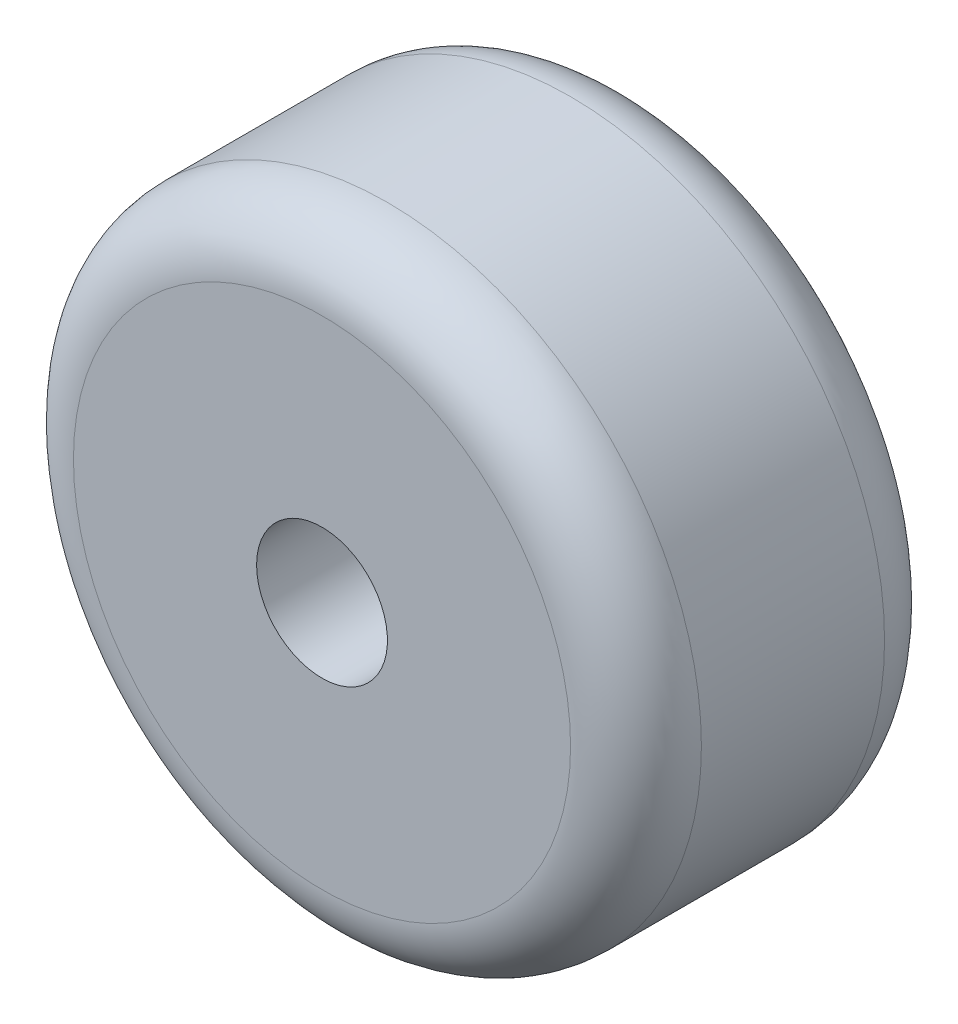
ISO-10303-21;
HEADER;
FILE_DESCRIPTION(('STEP AP214'),'2;1');
FILE_NAME('part.step','',(''),(''),'','','');
FILE_SCHEMA(('AUTOMOTIVE_DESIGN { 1 0 10303 214 1 1 1 1 }'));
ENDSEC;
DATA;
#1=APPLICATION_CONTEXT('core data for automotive mechanical design processes');
#2=APPLICATION_PROTOCOL_DEFINITION('international standard','automotive_design',2000,#1);
#3=PRODUCT_CONTEXT('',#1,'mechanical');
#4=PRODUCT('Part','Part','',(#3));
#5=PRODUCT_RELATED_PRODUCT_CATEGORY('part','',(#4));
#6=PRODUCT_DEFINITION_FORMATION('','',#4);
#7=PRODUCT_DEFINITION_CONTEXT('part definition',#1,'design');
#8=PRODUCT_DEFINITION('design','',#6,#7);
#9=PRODUCT_DEFINITION_SHAPE('','',#8);
#10=(LENGTH_UNIT() NAMED_UNIT(*) SI_UNIT(.MILLI.,.METRE.));
#11=(NAMED_UNIT(*) PLANE_ANGLE_UNIT() SI_UNIT($,.RADIAN.));
#12=(NAMED_UNIT(*) SI_UNIT($,.STERADIAN.) SOLID_ANGLE_UNIT());
#13=UNCERTAINTY_MEASURE_WITH_UNIT(LENGTH_MEASURE(1.E-05),#10,'distance_accuracy_value','');
#14=(GEOMETRIC_REPRESENTATION_CONTEXT(3) GLOBAL_UNCERTAINTY_ASSIGNED_CONTEXT((#13)) GLOBAL_UNIT_ASSIGNED_CONTEXT((#10,
#11,#12)) REPRESENTATION_CONTEXT('',''));
#15=CARTESIAN_POINT('',(0.,0.,0.));
#16=DIRECTION('',(0.,0.,1.));
#17=DIRECTION('',(1.,0.,0.));
#18=AXIS2_PLACEMENT_3D('',#15,#16,#17);
#19=CARTESIAN_POINT('',(0.,0.,24.));
#20=DIRECTION('',(0.,0.,-1.));
#21=DIRECTION('',(-1.,0.,0.));
#22=AXIS2_PLACEMENT_3D('',#19,#20,#21);
#23=CYLINDRICAL_SURFACE('',#22,24.);
#24=CARTESIAN_POINT('',(0.,0.,5.));
#25=DIRECTION('',(0.,0.,1.));
#26=DIRECTION('',(1.,0.,0.));
#27=AXIS2_PLACEMENT_3D('',#24,#25,#26);
#28=CIRCLE('',#27,24.);
#29=CARTESIAN_POINT('',(24.,0.,5.));
#30=VERTEX_POINT('',#29);
#31=EDGE_CURVE('E42',#30,#30,#28,.T.);
#32=ORIENTED_EDGE('',*,*,#31,.T.);
#33=EDGE_LOOP('',(#32));
#34=FACE_BOUND('',#33,.T.);
#35=CARTESIAN_POINT('',(0.,0.,19.));
#36=DIRECTION('',(0.,0.,1.));
#37=DIRECTION('',(1.,0.,0.));
#38=AXIS2_PLACEMENT_3D('',#35,#36,#37);
#39=CIRCLE('',#38,24.);
#40=CARTESIAN_POINT('',(24.,0.,19.));
#41=VERTEX_POINT('',#40);
#42=EDGE_CURVE('E46',#41,#41,#39,.F.);
#43=ORIENTED_EDGE('',*,*,#42,.T.);
#44=EDGE_LOOP('',(#43));
#45=FACE_BOUND('',#44,.T.);
#46=ADVANCED_FACE('F31',(#34,#45),#23,.T.);
#47=CARTESIAN_POINT('',(0.,0.,24.));
#48=DIRECTION('',(0.,0.,1.));
#49=DIRECTION('',(1.,0.,0.));
#50=AXIS2_PLACEMENT_3D('',#47,#48,#49);
#51=PLANE('',#50);
#52=CARTESIAN_POINT('',(0.,0.,24.));
#53=DIRECTION('',(0.,0.,-1.));
#54=DIRECTION('',(-1.,0.,0.));
#55=AXIS2_PLACEMENT_3D('',#52,#53,#54);
#56=CIRCLE('',#55,5.);
#57=CARTESIAN_POINT('',(-5.,0.,24.));
#58=VERTEX_POINT('',#57);
#59=EDGE_CURVE('E51',#58,#58,#56,.T.);
#60=ORIENTED_EDGE('',*,*,#59,.T.);
#61=EDGE_LOOP('',(#60));
#62=FACE_BOUND('',#61,.T.);
#63=CARTESIAN_POINT('',(0.,0.,24.));
#64=DIRECTION('',(0.,0.,1.));
#65=DIRECTION('',(1.,0.,0.));
#66=AXIS2_PLACEMENT_3D('',#63,#64,#65);
#67=CIRCLE('',#66,19.);
#68=CARTESIAN_POINT('',(19.,0.,24.));
#69=VERTEX_POINT('',#68);
#70=EDGE_CURVE('E10',#69,#69,#67,.T.);
#71=ORIENTED_EDGE('',*,*,#70,.T.);
#72=EDGE_LOOP('',(#71));
#73=FACE_BOUND('',#72,.T.);
#74=ADVANCED_FACE('F58',(#62,#73),#51,.T.);
#75=CARTESIAN_POINT('',(0.,0.,0.));
#76=DIRECTION('',(0.,0.,1.));
#77=DIRECTION('',(1.,0.,0.));
#78=AXIS2_PLACEMENT_3D('',#75,#76,#77);
#79=PLANE('',#78);
#80=CARTESIAN_POINT('',(0.,0.,0.));
#81=DIRECTION('',(0.,0.,-1.));
#82=DIRECTION('',(-1.,0.,0.));
#83=AXIS2_PLACEMENT_3D('',#80,#81,#82);
#84=CIRCLE('',#83,5.);
#85=CARTESIAN_POINT('',(-5.,0.,0.));
#86=VERTEX_POINT('',#85);
#87=EDGE_CURVE('E52',#86,#86,#84,.T.);
#88=ORIENTED_EDGE('',*,*,#87,.F.);
#89=EDGE_LOOP('',(#88));
#90=FACE_BOUND('',#89,.T.);
#91=CARTESIAN_POINT('',(0.,0.,0.));
#92=DIRECTION('',(0.,0.,1.));
#93=DIRECTION('',(1.,0.,0.));
#94=AXIS2_PLACEMENT_3D('',#91,#92,#93);
#95=CIRCLE('',#94,19.);
#96=CARTESIAN_POINT('',(19.,0.,0.));
#97=VERTEX_POINT('',#96);
#98=EDGE_CURVE('E38',#97,#97,#95,.F.);
#99=ORIENTED_EDGE('',*,*,#98,.T.);
#100=EDGE_LOOP('',(#99));
#101=FACE_BOUND('',#100,.T.);
#102=ADVANCED_FACE('F66',(#90,#101),#79,.F.);
#103=CARTESIAN_POINT('',(0.,0.,5.));
#104=DIRECTION('',(0.,0.,1.));
#105=DIRECTION('',(1.,0.,0.));
#106=AXIS2_PLACEMENT_3D('',#103,#104,#105);
#107=TOROIDAL_SURFACE('',#106,19.,5.);
#108=ORIENTED_EDGE('',*,*,#98,.F.);
#109=EDGE_LOOP('',(#108));
#110=FACE_BOUND('',#109,.T.);
#111=ORIENTED_EDGE('',*,*,#31,.F.);
#112=EDGE_LOOP('',(#111));
#113=FACE_BOUND('',#112,.T.);
#114=ADVANCED_FACE('F68',(#110,#113),#107,.T.);
#115=CARTESIAN_POINT('',(0.,0.,19.));
#116=DIRECTION('',(0.,0.,1.));
#117=DIRECTION('',(1.,0.,0.));
#118=AXIS2_PLACEMENT_3D('',#115,#116,#117);
#119=TOROIDAL_SURFACE('',#118,19.,5.);
#120=ORIENTED_EDGE('',*,*,#42,.F.);
#121=EDGE_LOOP('',(#120));
#122=FACE_BOUND('',#121,.T.);
#123=ORIENTED_EDGE('',*,*,#70,.F.);
#124=EDGE_LOOP('',(#123));
#125=FACE_BOUND('',#124,.T.);
#126=ADVANCED_FACE('F33',(#122,#125),#119,.T.);
#127=CARTESIAN_POINT('',(0.,0.,24.));
#128=DIRECTION('',(0.,0.,-1.));
#129=DIRECTION('',(-1.,0.,0.));
#130=AXIS2_PLACEMENT_3D('',#127,#128,#129);
#131=CYLINDRICAL_SURFACE('',#130,5.);
#132=ORIENTED_EDGE('',*,*,#59,.F.);
#133=EDGE_LOOP('',(#132));
#134=FACE_BOUND('',#133,.T.);
#135=ORIENTED_EDGE('',*,*,#87,.T.);
#136=EDGE_LOOP('',(#135));
#137=FACE_BOUND('',#136,.T.);
#138=ADVANCED_FACE('F60',(#134,#137),#131,.F.);
#139=CLOSED_SHELL('',(#46,#74,#102,#114,#126,#138));
#140=MANIFOLD_SOLID_BREP('B2',#139);
#141=ADVANCED_BREP_SHAPE_REPRESENTATION('',(#18,#140),#14);
#142=SHAPE_DEFINITION_REPRESENTATION(#9,#141);
ENDSEC;
END-ISO-10303-21;
